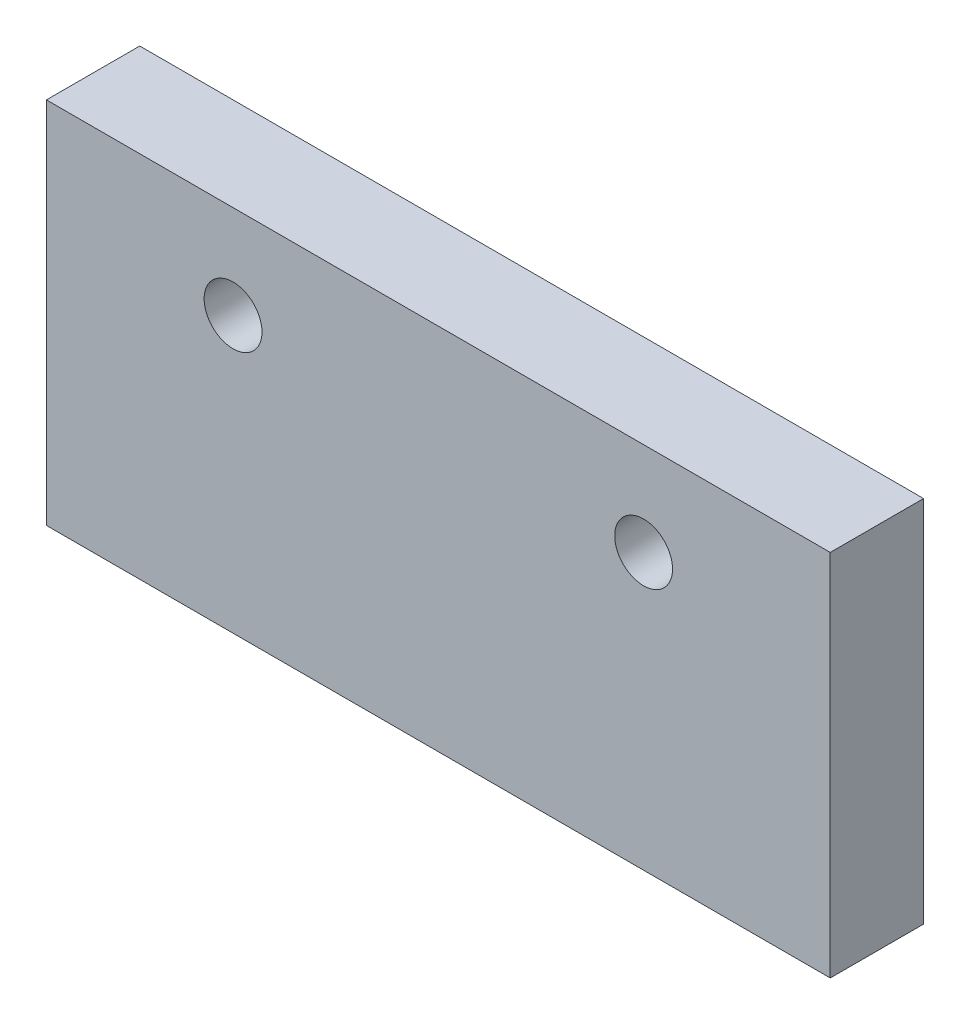
ISO-10303-21;
HEADER;
FILE_DESCRIPTION(('STEP AP214'),'2;1');
FILE_NAME('part.step','',(''),(''),'','','');
FILE_SCHEMA(('AUTOMOTIVE_DESIGN { 1 0 10303 214 1 1 1 1 }'));
ENDSEC;
DATA;
#1=APPLICATION_CONTEXT('core data for automotive mechanical design processes');
#2=APPLICATION_PROTOCOL_DEFINITION('international standard','automotive_design',2000,#1);
#3=PRODUCT_CONTEXT('',#1,'mechanical');
#4=PRODUCT('Part','Part','',(#3));
#5=PRODUCT_RELATED_PRODUCT_CATEGORY('part','',(#4));
#6=PRODUCT_DEFINITION_FORMATION('','',#4);
#7=PRODUCT_DEFINITION_CONTEXT('part definition',#1,'design');
#8=PRODUCT_DEFINITION('design','',#6,#7);
#9=PRODUCT_DEFINITION_SHAPE('','',#8);
#10=(LENGTH_UNIT() NAMED_UNIT(*) SI_UNIT(.MILLI.,.METRE.));
#11=(NAMED_UNIT(*) PLANE_ANGLE_UNIT() SI_UNIT($,.RADIAN.));
#12=(NAMED_UNIT(*) SI_UNIT($,.STERADIAN.) SOLID_ANGLE_UNIT());
#13=UNCERTAINTY_MEASURE_WITH_UNIT(LENGTH_MEASURE(1.E-05),#10,'distance_accuracy_value','');
#14=(GEOMETRIC_REPRESENTATION_CONTEXT(3) GLOBAL_UNCERTAINTY_ASSIGNED_CONTEXT((#13)) GLOBAL_UNIT_ASSIGNED_CONTEXT((#10,
#11,#12)) REPRESENTATION_CONTEXT('',''));
#15=CARTESIAN_POINT('',(0.,0.,0.));
#16=DIRECTION('',(0.,0.,1.));
#17=DIRECTION('',(1.,0.,0.));
#18=AXIS2_PLACEMENT_3D('',#15,#16,#17);
#19=CARTESIAN_POINT('',(42.,0.,5.));
#20=DIRECTION('',(1.,0.,0.));
#21=DIRECTION('',(0.,0.,-1.));
#22=AXIS2_PLACEMENT_3D('',#19,#20,#21);
#23=PLANE('',#22);
#24=DIRECTION('',(0.,-1.,0.));
#25=VECTOR('',#24,1.);
#26=CARTESIAN_POINT('',(42.,0.,0.));
#27=LINE('',#26,#25);
#28=CARTESIAN_POINT('',(42.,17.,0.));
#29=VERTEX_POINT('',#28);
#30=CARTESIAN_POINT('',(42.,-2.75,0.));
#31=VERTEX_POINT('',#30);
#32=EDGE_CURVE('E123',#29,#31,#27,.T.);
#33=ORIENTED_EDGE('',*,*,#32,.F.);
#34=DIRECTION('',(0.,0.,-1.));
#35=VECTOR('',#34,1.);
#36=CARTESIAN_POINT('',(42.,17.,5.));
#37=LINE('',#36,#35);
#38=CARTESIAN_POINT('',(42.,17.,5.));
#39=VERTEX_POINT('',#38);
#40=EDGE_CURVE('E11',#39,#29,#37,.T.);
#41=ORIENTED_EDGE('',*,*,#40,.F.);
#42=DIRECTION('',(0.,-1.,0.));
#43=VECTOR('',#42,1.);
#44=CARTESIAN_POINT('',(42.,0.,5.));
#45=LINE('',#44,#43);
#46=CARTESIAN_POINT('',(42.,-2.75,5.));
#47=VERTEX_POINT('',#46);
#48=EDGE_CURVE('E105',#39,#47,#45,.T.);
#49=ORIENTED_EDGE('',*,*,#48,.T.);
#50=DIRECTION('',(0.,0.,-1.));
#51=VECTOR('',#50,1.);
#52=CARTESIAN_POINT('',(42.,-2.75,5.));
#53=LINE('',#52,#51);
#54=EDGE_CURVE('E82',#47,#31,#53,.T.);
#55=ORIENTED_EDGE('',*,*,#54,.T.);
#56=EDGE_LOOP('',(#33,#41,#49,#55));
#57=FACE_BOUND('',#56,.T.);
#58=ADVANCED_FACE('F41',(#57),#23,.T.);
#59=CARTESIAN_POINT('',(0.,17.,5.));
#60=DIRECTION('',(0.,1.,0.));
#61=DIRECTION('',(0.,0.,1.));
#62=AXIS2_PLACEMENT_3D('',#59,#60,#61);
#63=PLANE('',#62);
#64=DIRECTION('',(1.,0.,0.));
#65=VECTOR('',#64,1.);
#66=CARTESIAN_POINT('',(0.,17.,0.));
#67=LINE('',#66,#65);
#68=CARTESIAN_POINT('',(0.,17.,0.));
#69=VERTEX_POINT('',#68);
#70=EDGE_CURVE('E94',#69,#29,#67,.T.);
#71=ORIENTED_EDGE('',*,*,#70,.F.);
#72=DIRECTION('',(0.,0.,-1.));
#73=VECTOR('',#72,1.);
#74=CARTESIAN_POINT('',(0.,17.,5.));
#75=LINE('',#74,#73);
#76=CARTESIAN_POINT('',(0.,17.,5.));
#77=VERTEX_POINT('',#76);
#78=EDGE_CURVE('E51',#77,#69,#75,.T.);
#79=ORIENTED_EDGE('',*,*,#78,.F.);
#80=DIRECTION('',(1.,0.,0.));
#81=VECTOR('',#80,1.);
#82=CARTESIAN_POINT('',(0.,17.,5.));
#83=LINE('',#82,#81);
#84=EDGE_CURVE('E92',#77,#39,#83,.T.);
#85=ORIENTED_EDGE('',*,*,#84,.T.);
#86=ORIENTED_EDGE('',*,*,#40,.T.);
#87=EDGE_LOOP('',(#71,#79,#85,#86));
#88=FACE_BOUND('',#87,.T.);
#89=ADVANCED_FACE('F90',(#88),#63,.T.);
#90=CARTESIAN_POINT('',(0.,0.,5.));
#91=DIRECTION('',(1.,0.,0.));
#92=DIRECTION('',(0.,0.,-1.));
#93=AXIS2_PLACEMENT_3D('',#90,#91,#92);
#94=PLANE('',#93);
#95=DIRECTION('',(0.,-1.,0.));
#96=VECTOR('',#95,1.);
#97=CARTESIAN_POINT('',(0.,0.,0.));
#98=LINE('',#97,#96);
#99=CARTESIAN_POINT('',(0.,-2.75,0.));
#100=VERTEX_POINT('',#99);
#101=EDGE_CURVE('E128',#69,#100,#98,.T.);
#102=ORIENTED_EDGE('',*,*,#101,.T.);
#103=DIRECTION('',(0.,0.,-1.));
#104=VECTOR('',#103,1.);
#105=CARTESIAN_POINT('',(0.,-2.75,5.));
#106=LINE('',#105,#104);
#107=CARTESIAN_POINT('',(0.,-2.75,5.));
#108=VERTEX_POINT('',#107);
#109=EDGE_CURVE('E98',#108,#100,#106,.T.);
#110=ORIENTED_EDGE('',*,*,#109,.F.);
#111=DIRECTION('',(0.,-1.,0.));
#112=VECTOR('',#111,1.);
#113=CARTESIAN_POINT('',(0.,0.,5.));
#114=LINE('',#113,#112);
#115=EDGE_CURVE('E100',#77,#108,#114,.T.);
#116=ORIENTED_EDGE('',*,*,#115,.F.);
#117=ORIENTED_EDGE('',*,*,#78,.T.);
#118=EDGE_LOOP('',(#102,#110,#116,#117));
#119=FACE_BOUND('',#118,.T.);
#120=ADVANCED_FACE('F101',(#119),#94,.F.);
#121=CARTESIAN_POINT('',(10.,12.,5.));
#122=DIRECTION('',(0.,0.,-1.));
#123=DIRECTION('',(-1.,0.,0.));
#124=AXIS2_PLACEMENT_3D('',#121,#122,#123);
#125=CYLINDRICAL_SURFACE('',#124,1.55);
#126=CARTESIAN_POINT('',(10.,12.,5.));
#127=DIRECTION('',(0.,0.,1.));
#128=DIRECTION('',(1.,0.,0.));
#129=AXIS2_PLACEMENT_3D('',#126,#127,#128);
#130=CIRCLE('',#129,1.55);
#131=CARTESIAN_POINT('',(11.55,12.,5.));
#132=VERTEX_POINT('',#131);
#133=EDGE_CURVE('E109',#132,#132,#130,.T.);
#134=ORIENTED_EDGE('',*,*,#133,.T.);
#135=EDGE_LOOP('',(#134));
#136=FACE_BOUND('',#135,.T.);
#137=CARTESIAN_POINT('',(10.,12.,0.));
#138=DIRECTION('',(0.,0.,1.));
#139=DIRECTION('',(1.,0.,0.));
#140=AXIS2_PLACEMENT_3D('',#137,#138,#139);
#141=CIRCLE('',#140,1.55);
#142=CARTESIAN_POINT('',(11.55,12.,0.));
#143=VERTEX_POINT('',#142);
#144=EDGE_CURVE('E119',#143,#143,#141,.T.);
#145=ORIENTED_EDGE('',*,*,#144,.F.);
#146=EDGE_LOOP('',(#145));
#147=FACE_BOUND('',#146,.T.);
#148=ADVANCED_FACE('F147',(#136,#147),#125,.F.);
#149=CARTESIAN_POINT('',(32.,12.,5.));
#150=DIRECTION('',(0.,0.,-1.));
#151=DIRECTION('',(-1.,0.,0.));
#152=AXIS2_PLACEMENT_3D('',#149,#150,#151);
#153=CYLINDRICAL_SURFACE('',#152,1.55);
#154=CARTESIAN_POINT('',(32.,12.,5.));
#155=DIRECTION('',(0.,0.,1.));
#156=DIRECTION('',(1.,0.,0.));
#157=AXIS2_PLACEMENT_3D('',#154,#155,#156);
#158=CIRCLE('',#157,1.55);
#159=CARTESIAN_POINT('',(33.55,12.,5.));
#160=VERTEX_POINT('',#159);
#161=EDGE_CURVE('E133',#160,#160,#158,.T.);
#162=ORIENTED_EDGE('',*,*,#161,.T.);
#163=EDGE_LOOP('',(#162));
#164=FACE_BOUND('',#163,.T.);
#165=CARTESIAN_POINT('',(32.,12.,0.));
#166=DIRECTION('',(0.,0.,1.));
#167=DIRECTION('',(1.,0.,0.));
#168=AXIS2_PLACEMENT_3D('',#165,#166,#167);
#169=CIRCLE('',#168,1.55);
#170=CARTESIAN_POINT('',(33.55,12.,0.));
#171=VERTEX_POINT('',#170);
#172=EDGE_CURVE('E115',#171,#171,#169,.T.);
#173=ORIENTED_EDGE('',*,*,#172,.F.);
#174=EDGE_LOOP('',(#173));
#175=FACE_BOUND('',#174,.T.);
#176=ADVANCED_FACE('F43',(#164,#175),#153,.F.);
#177=CARTESIAN_POINT('',(0.,-2.75,5.));
#178=DIRECTION('',(0.,1.,0.));
#179=DIRECTION('',(0.,0.,1.));
#180=AXIS2_PLACEMENT_3D('',#177,#178,#179);
#181=PLANE('',#180);
#182=DIRECTION('',(1.,0.,0.));
#183=VECTOR('',#182,1.);
#184=CARTESIAN_POINT('',(0.,-2.75,0.));
#185=LINE('',#184,#183);
#186=EDGE_CURVE('E75',#100,#31,#185,.T.);
#187=ORIENTED_EDGE('',*,*,#186,.T.);
#188=ORIENTED_EDGE('',*,*,#54,.F.);
#189=DIRECTION('',(1.,0.,0.));
#190=VECTOR('',#189,1.);
#191=CARTESIAN_POINT('',(0.,-2.75,5.));
#192=LINE('',#191,#190);
#193=EDGE_CURVE('E59',#108,#47,#192,.T.);
#194=ORIENTED_EDGE('',*,*,#193,.F.);
#195=ORIENTED_EDGE('',*,*,#109,.T.);
#196=EDGE_LOOP('',(#187,#188,#194,#195));
#197=FACE_BOUND('',#196,.T.);
#198=ADVANCED_FACE('F138',(#197),#181,.F.);
#199=CARTESIAN_POINT('',(0.,0.,5.));
#200=DIRECTION('',(0.,0.,1.));
#201=DIRECTION('',(1.,0.,0.));
#202=AXIS2_PLACEMENT_3D('',#199,#200,#201);
#203=PLANE('',#202);
#204=ORIENTED_EDGE('',*,*,#161,.F.);
#205=EDGE_LOOP('',(#204));
#206=FACE_BOUND('',#205,.T.);
#207=ORIENTED_EDGE('',*,*,#133,.F.);
#208=EDGE_LOOP('',(#207));
#209=FACE_BOUND('',#208,.T.);
#210=ORIENTED_EDGE('',*,*,#48,.F.);
#211=ORIENTED_EDGE('',*,*,#84,.F.);
#212=ORIENTED_EDGE('',*,*,#115,.T.);
#213=ORIENTED_EDGE('',*,*,#193,.T.);
#214=EDGE_LOOP('',(#210,#211,#212,#213));
#215=FACE_BOUND('',#214,.T.);
#216=ADVANCED_FACE('F104',(#206,#209,#215),#203,.T.);
#217=CARTESIAN_POINT('',(0.,0.,0.));
#218=DIRECTION('',(0.,0.,1.));
#219=DIRECTION('',(1.,0.,0.));
#220=AXIS2_PLACEMENT_3D('',#217,#218,#219);
#221=PLANE('',#220);
#222=ORIENTED_EDGE('',*,*,#172,.T.);
#223=EDGE_LOOP('',(#222));
#224=FACE_BOUND('',#223,.T.);
#225=ORIENTED_EDGE('',*,*,#144,.T.);
#226=EDGE_LOOP('',(#225));
#227=FACE_BOUND('',#226,.T.);
#228=ORIENTED_EDGE('',*,*,#32,.T.);
#229=ORIENTED_EDGE('',*,*,#186,.F.);
#230=ORIENTED_EDGE('',*,*,#101,.F.);
#231=ORIENTED_EDGE('',*,*,#70,.T.);
#232=EDGE_LOOP('',(#228,#229,#230,#231));
#233=FACE_BOUND('',#232,.T.);
#234=ADVANCED_FACE('F139',(#224,#227,#233),#221,.F.);
#235=CLOSED_SHELL('',(#58,#89,#120,#148,#176,#198,#216,#234));
#236=MANIFOLD_SOLID_BREP('B2',#235);
#237=ADVANCED_BREP_SHAPE_REPRESENTATION('',(#18,#236),#14);
#238=SHAPE_DEFINITION_REPRESENTATION(#9,#237);
ENDSEC;
END-ISO-10303-21;
